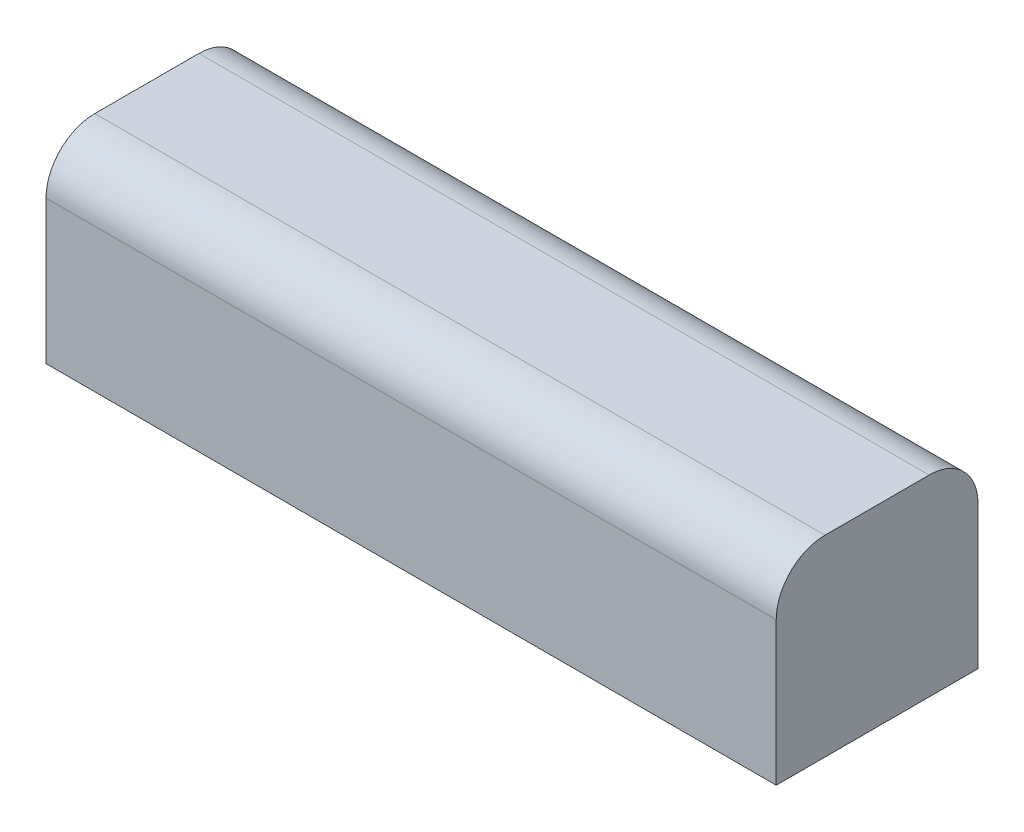
ISO-10303-21;
HEADER;
FILE_DESCRIPTION(('STEP AP214'),'2;1');
FILE_NAME('part.step','',(''),(''),'','','');
FILE_SCHEMA(('AUTOMOTIVE_DESIGN { 1 0 10303 214 1 1 1 1 }'));
ENDSEC;
DATA;
#1=APPLICATION_CONTEXT('core data for automotive mechanical design processes');
#2=APPLICATION_PROTOCOL_DEFINITION('international standard','automotive_design',2000,#1);
#3=PRODUCT_CONTEXT('',#1,'mechanical');
#4=PRODUCT('Part','Part','',(#3));
#5=PRODUCT_RELATED_PRODUCT_CATEGORY('part','',(#4));
#6=PRODUCT_DEFINITION_FORMATION('','',#4);
#7=PRODUCT_DEFINITION_CONTEXT('part definition',#1,'design');
#8=PRODUCT_DEFINITION('design','',#6,#7);
#9=PRODUCT_DEFINITION_SHAPE('','',#8);
#10=(LENGTH_UNIT() NAMED_UNIT(*) SI_UNIT(.MILLI.,.METRE.));
#11=(NAMED_UNIT(*) PLANE_ANGLE_UNIT() SI_UNIT($,.RADIAN.));
#12=(NAMED_UNIT(*) SI_UNIT($,.STERADIAN.) SOLID_ANGLE_UNIT());
#13=UNCERTAINTY_MEASURE_WITH_UNIT(LENGTH_MEASURE(1.E-05),#10,'distance_accuracy_value','');
#14=(GEOMETRIC_REPRESENTATION_CONTEXT(3) GLOBAL_UNCERTAINTY_ASSIGNED_CONTEXT((#13)) GLOBAL_UNIT_ASSIGNED_CONTEXT((#10,
#11,#12)) REPRESENTATION_CONTEXT('',''));
#15=CARTESIAN_POINT('',(0.,0.,0.));
#16=DIRECTION('',(0.,0.,1.));
#17=DIRECTION('',(1.,0.,0.));
#18=AXIS2_PLACEMENT_3D('',#15,#16,#17);
#19=CARTESIAN_POINT('',(38.,20.,10.5));
#20=DIRECTION('',(-1.,0.,0.));
#21=DIRECTION('',(0.,0.,1.));
#22=AXIS2_PLACEMENT_3D('',#19,#20,#21);
#23=PLANE('',#22);
#24=DIRECTION('',(0.,-1.,0.));
#25=VECTOR('',#24,1.);
#26=CARTESIAN_POINT('',(38.,20.,-10.5));
#27=LINE('',#26,#25);
#28=CARTESIAN_POINT('',(38.,14.92,-10.5));
#29=VERTEX_POINT('',#28);
#30=CARTESIAN_POINT('',(38.,0.,-10.5));
#31=VERTEX_POINT('',#30);
#32=EDGE_CURVE('E97',#29,#31,#27,.T.);
#33=ORIENTED_EDGE('',*,*,#32,.F.);
#34=CARTESIAN_POINT('',(38.,14.92,-5.42));
#35=DIRECTION('',(-1.,0.,0.));
#36=DIRECTION('',(0.,0.,1.));
#37=AXIS2_PLACEMENT_3D('',#34,#35,#36);
#38=CIRCLE('',#37,5.08);
#39=CARTESIAN_POINT('',(38.,20.,-5.41999999999999));
#40=VERTEX_POINT('',#39);
#41=EDGE_CURVE('E54',#29,#40,#38,.F.);
#42=ORIENTED_EDGE('',*,*,#41,.T.);
#43=DIRECTION('',(0.,0.,-1.));
#44=VECTOR('',#43,1.);
#45=CARTESIAN_POINT('',(38.,20.,10.5));
#46=LINE('',#45,#44);
#47=CARTESIAN_POINT('',(38.,20.,5.42));
#48=VERTEX_POINT('',#47);
#49=EDGE_CURVE('E135',#48,#40,#46,.T.);
#50=ORIENTED_EDGE('',*,*,#49,.F.);
#51=CARTESIAN_POINT('',(38.,14.92,5.42));
#52=DIRECTION('',(-1.,0.,0.));
#53=DIRECTION('',(0.,0.,1.));
#54=AXIS2_PLACEMENT_3D('',#51,#52,#53);
#55=CIRCLE('',#54,5.08);
#56=CARTESIAN_POINT('',(38.,14.92,10.5));
#57=VERTEX_POINT('',#56);
#58=EDGE_CURVE('E61',#48,#57,#55,.F.);
#59=ORIENTED_EDGE('',*,*,#58,.T.);
#60=DIRECTION('',(0.,-1.,0.));
#61=VECTOR('',#60,1.);
#62=CARTESIAN_POINT('',(38.,20.,10.5));
#63=LINE('',#62,#61);
#64=CARTESIAN_POINT('',(38.,0.,10.5));
#65=VERTEX_POINT('',#64);
#66=EDGE_CURVE('E117',#57,#65,#63,.T.);
#67=ORIENTED_EDGE('',*,*,#66,.T.);
#68=DIRECTION('',(0.,0.,-1.));
#69=VECTOR('',#68,1.);
#70=CARTESIAN_POINT('',(38.,0.,10.5));
#71=LINE('',#70,#69);
#72=EDGE_CURVE('E112',#65,#31,#71,.T.);
#73=ORIENTED_EDGE('',*,*,#72,.T.);
#74=EDGE_LOOP('',(#33,#42,#50,#59,#67,#73));
#75=FACE_BOUND('',#74,.T.);
#76=ADVANCED_FACE('F45',(#75),#23,.F.);
#77=CARTESIAN_POINT('',(-38.,20.,-10.5));
#78=DIRECTION('',(0.,0.,1.));
#79=DIRECTION('',(1.,0.,0.));
#80=AXIS2_PLACEMENT_3D('',#77,#78,#79);
#81=PLANE('',#80);
#82=DIRECTION('',(0.,-1.,0.));
#83=VECTOR('',#82,1.);
#84=CARTESIAN_POINT('',(-38.,20.,-10.5));
#85=LINE('',#84,#83);
#86=CARTESIAN_POINT('',(-38.,14.92,-10.5));
#87=VERTEX_POINT('',#86);
#88=CARTESIAN_POINT('',(-38.,0.,-10.5));
#89=VERTEX_POINT('',#88);
#90=EDGE_CURVE('E106',#87,#89,#85,.T.);
#91=ORIENTED_EDGE('',*,*,#90,.F.);
#92=DIRECTION('',(-1.,0.,0.));
#93=VECTOR('',#92,1.);
#94=CARTESIAN_POINT('',(-38.,14.92,-10.5));
#95=LINE('',#94,#93);
#96=EDGE_CURVE('E69',#87,#29,#95,.F.);
#97=ORIENTED_EDGE('',*,*,#96,.T.);
#98=ORIENTED_EDGE('',*,*,#32,.T.);
#99=DIRECTION('',(-1.,0.,0.));
#100=VECTOR('',#99,1.);
#101=CARTESIAN_POINT('',(-38.,0.,-10.5));
#102=LINE('',#101,#100);
#103=EDGE_CURVE('E100',#31,#89,#102,.T.);
#104=ORIENTED_EDGE('',*,*,#103,.T.);
#105=EDGE_LOOP('',(#91,#97,#98,#104));
#106=FACE_BOUND('',#105,.T.);
#107=ADVANCED_FACE('F99',(#106),#81,.F.);
#108=CARTESIAN_POINT('',(-38.,20.,10.5));
#109=DIRECTION('',(1.,0.,0.));
#110=DIRECTION('',(0.,0.,-1.));
#111=AXIS2_PLACEMENT_3D('',#108,#109,#110);
#112=PLANE('',#111);
#113=DIRECTION('',(0.,0.,1.));
#114=VECTOR('',#113,1.);
#115=CARTESIAN_POINT('',(-38.,20.,10.5));
#116=LINE('',#115,#114);
#117=CARTESIAN_POINT('',(-38.,20.,-5.41999999999999));
#118=VERTEX_POINT('',#117);
#119=CARTESIAN_POINT('',(-38.,20.,5.42));
#120=VERTEX_POINT('',#119);
#121=EDGE_CURVE('E127',#118,#120,#116,.T.);
#122=ORIENTED_EDGE('',*,*,#121,.F.);
#123=CARTESIAN_POINT('',(-38.,14.92,-5.42));
#124=DIRECTION('',(1.,0.,0.));
#125=DIRECTION('',(0.,0.,-1.));
#126=AXIS2_PLACEMENT_3D('',#123,#124,#125);
#127=CIRCLE('',#126,5.08);
#128=EDGE_CURVE('E153',#118,#87,#127,.F.);
#129=ORIENTED_EDGE('',*,*,#128,.T.);
#130=ORIENTED_EDGE('',*,*,#90,.T.);
#131=DIRECTION('',(0.,0.,1.));
#132=VECTOR('',#131,1.);
#133=CARTESIAN_POINT('',(-38.,0.,10.5));
#134=LINE('',#133,#132);
#135=CARTESIAN_POINT('',(-38.,0.,10.5));
#136=VERTEX_POINT('',#135);
#137=EDGE_CURVE('E114',#89,#136,#134,.T.);
#138=ORIENTED_EDGE('',*,*,#137,.T.);
#139=DIRECTION('',(0.,-1.,0.));
#140=VECTOR('',#139,1.);
#141=CARTESIAN_POINT('',(-38.,20.,10.5));
#142=LINE('',#141,#140);
#143=CARTESIAN_POINT('',(-38.,14.92,10.5));
#144=VERTEX_POINT('',#143);
#145=EDGE_CURVE('E138',#144,#136,#142,.T.);
#146=ORIENTED_EDGE('',*,*,#145,.F.);
#147=CARTESIAN_POINT('',(-38.,14.92,5.42));
#148=DIRECTION('',(1.,0.,0.));
#149=DIRECTION('',(0.,0.,-1.));
#150=AXIS2_PLACEMENT_3D('',#147,#148,#149);
#151=CIRCLE('',#150,5.08);
#152=EDGE_CURVE('E150',#144,#120,#151,.F.);
#153=ORIENTED_EDGE('',*,*,#152,.T.);
#154=EDGE_LOOP('',(#122,#129,#130,#138,#146,#153));
#155=FACE_BOUND('',#154,.T.);
#156=ADVANCED_FACE('F171',(#155),#112,.F.);
#157=CARTESIAN_POINT('',(-38.,20.,10.5));
#158=DIRECTION('',(0.,0.,-1.));
#159=DIRECTION('',(-1.,0.,0.));
#160=AXIS2_PLACEMENT_3D('',#157,#158,#159);
#161=PLANE('',#160);
#162=ORIENTED_EDGE('',*,*,#66,.F.);
#163=DIRECTION('',(1.,0.,0.));
#164=VECTOR('',#163,1.);
#165=CARTESIAN_POINT('',(-38.,14.92,10.5));
#166=LINE('',#165,#164);
#167=EDGE_CURVE('E11',#57,#144,#166,.F.);
#168=ORIENTED_EDGE('',*,*,#167,.T.);
#169=ORIENTED_EDGE('',*,*,#145,.T.);
#170=DIRECTION('',(1.,0.,0.));
#171=VECTOR('',#170,1.);
#172=CARTESIAN_POINT('',(-38.,0.,10.5));
#173=LINE('',#172,#171);
#174=EDGE_CURVE('E132',#136,#65,#173,.T.);
#175=ORIENTED_EDGE('',*,*,#174,.T.);
#176=EDGE_LOOP('',(#162,#168,#169,#175));
#177=FACE_BOUND('',#176,.T.);
#178=ADVANCED_FACE('F178',(#177),#161,.F.);
#179=CARTESIAN_POINT('',(0.,20.,0.));
#180=DIRECTION('',(0.,-1.,0.));
#181=DIRECTION('',(0.,0.,-1.));
#182=AXIS2_PLACEMENT_3D('',#179,#180,#181);
#183=PLANE('',#182);
#184=ORIENTED_EDGE('',*,*,#49,.T.);
#185=DIRECTION('',(-1.,0.,0.));
#186=VECTOR('',#185,1.);
#187=CARTESIAN_POINT('',(0.,20.,-5.42));
#188=LINE('',#187,#186);
#189=EDGE_CURVE('E146',#40,#118,#188,.T.);
#190=ORIENTED_EDGE('',*,*,#189,.T.);
#191=ORIENTED_EDGE('',*,*,#121,.T.);
#192=DIRECTION('',(1.,0.,0.));
#193=VECTOR('',#192,1.);
#194=CARTESIAN_POINT('',(0.,20.,5.42));
#195=LINE('',#194,#193);
#196=EDGE_CURVE('E105',#120,#48,#195,.T.);
#197=ORIENTED_EDGE('',*,*,#196,.T.);
#198=EDGE_LOOP('',(#184,#190,#191,#197));
#199=FACE_BOUND('',#198,.T.);
#200=ADVANCED_FACE('F164',(#199),#183,.F.);
#201=CARTESIAN_POINT('',(0.,0.,0.));
#202=DIRECTION('',(0.,-1.,0.));
#203=DIRECTION('',(0.,0.,-1.));
#204=AXIS2_PLACEMENT_3D('',#201,#202,#203);
#205=PLANE('',#204);
#206=CARTESIAN_POINT('',(0.,0.,0.));
#207=DIRECTION('',(0.,-1.,0.));
#208=DIRECTION('',(0.,0.,-1.));
#209=AXIS2_PLACEMENT_3D('',#206,#207,#208);
#210=CIRCLE('',#209,1.5);
#211=CARTESIAN_POINT('',(0.,0.,-1.5));
#212=VERTEX_POINT('',#211);
#213=EDGE_CURVE('E124',#212,#212,#210,.T.);
#214=ORIENTED_EDGE('',*,*,#213,.F.);
#215=EDGE_LOOP('',(#214));
#216=FACE_BOUND('',#215,.T.);
#217=ORIENTED_EDGE('',*,*,#72,.F.);
#218=ORIENTED_EDGE('',*,*,#174,.F.);
#219=ORIENTED_EDGE('',*,*,#137,.F.);
#220=ORIENTED_EDGE('',*,*,#103,.F.);
#221=EDGE_LOOP('',(#217,#218,#219,#220));
#222=FACE_BOUND('',#221,.T.);
#223=ADVANCED_FACE('F110',(#216,#222),#205,.T.);
#224=CARTESIAN_POINT('',(0.,14.92,-5.42));
#225=DIRECTION('',(-1.,0.,0.));
#226=DIRECTION('',(0.,0.,1.));
#227=AXIS2_PLACEMENT_3D('',#224,#225,#226);
#228=CYLINDRICAL_SURFACE('',#227,5.08);
#229=ORIENTED_EDGE('',*,*,#41,.F.);
#230=ORIENTED_EDGE('',*,*,#96,.F.);
#231=ORIENTED_EDGE('',*,*,#128,.F.);
#232=ORIENTED_EDGE('',*,*,#189,.F.);
#233=EDGE_LOOP('',(#229,#230,#231,#232));
#234=FACE_BOUND('',#233,.T.);
#235=ADVANCED_FACE('F169',(#234),#228,.T.);
#236=CARTESIAN_POINT('',(0.,14.92,5.42));
#237=DIRECTION('',(1.,0.,0.));
#238=DIRECTION('',(0.,0.,-1.));
#239=AXIS2_PLACEMENT_3D('',#236,#237,#238);
#240=CYLINDRICAL_SURFACE('',#239,5.08);
#241=ORIENTED_EDGE('',*,*,#152,.F.);
#242=ORIENTED_EDGE('',*,*,#167,.F.);
#243=ORIENTED_EDGE('',*,*,#58,.F.);
#244=ORIENTED_EDGE('',*,*,#196,.F.);
#245=EDGE_LOOP('',(#241,#242,#243,#244));
#246=FACE_BOUND('',#245,.T.);
#247=ADVANCED_FACE('F47',(#246),#240,.T.);
#248=CARTESIAN_POINT('',(0.,2.54,0.));
#249=DIRECTION('',(0.,-1.,0.));
#250=DIRECTION('',(0.,0.,-1.));
#251=AXIS2_PLACEMENT_3D('',#248,#249,#250);
#252=CYLINDRICAL_SURFACE('',#251,1.5);
#253=CARTESIAN_POINT('',(0.,2.54,0.));
#254=DIRECTION('',(0.,-1.,0.));
#255=DIRECTION('',(0.,0.,-1.));
#256=AXIS2_PLACEMENT_3D('',#253,#254,#255);
#257=CIRCLE('',#256,1.5);
#258=CARTESIAN_POINT('',(0.,2.54,-1.5));
#259=VERTEX_POINT('',#258);
#260=EDGE_CURVE('E120',#259,#259,#257,.T.);
#261=ORIENTED_EDGE('',*,*,#260,.F.);
#262=EDGE_LOOP('',(#261));
#263=FACE_BOUND('',#262,.T.);
#264=ORIENTED_EDGE('',*,*,#213,.T.);
#265=EDGE_LOOP('',(#264));
#266=FACE_BOUND('',#265,.T.);
#267=ADVANCED_FACE('F198',(#263,#266),#252,.F.);
#268=CARTESIAN_POINT('',(0.,2.54,0.));
#269=DIRECTION('',(0.,-1.,0.));
#270=DIRECTION('',(0.,0.,-1.));
#271=AXIS2_PLACEMENT_3D('',#268,#269,#270);
#272=PLANE('',#271);
#273=ORIENTED_EDGE('',*,*,#260,.T.);
#274=EDGE_LOOP('',(#273));
#275=FACE_BOUND('',#274,.T.);
#276=ADVANCED_FACE('F207',(#275),#272,.T.);
#277=CLOSED_SHELL('',(#76,#107,#156,#178,#200,#223,#235,#247,#267,#276));
#278=MANIFOLD_SOLID_BREP('B2',#277);
#279=ADVANCED_BREP_SHAPE_REPRESENTATION('',(#18,#278),#14);
#280=SHAPE_DEFINITION_REPRESENTATION(#9,#279);
ENDSEC;
END-ISO-10303-21;
